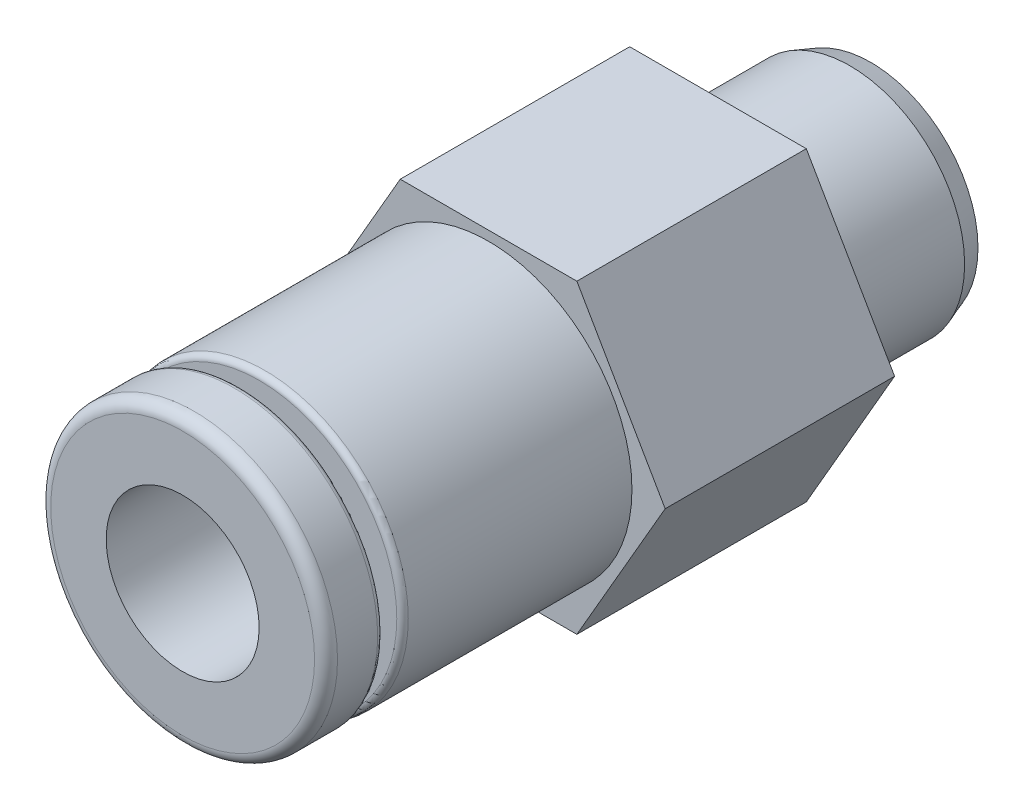
ISO-10303-21;
HEADER;
FILE_DESCRIPTION(('STEP AP214'),'2;1');
FILE_NAME('part.step','',(''),(''),'','','');
FILE_SCHEMA(('AUTOMOTIVE_DESIGN { 1 0 10303 214 1 1 1 1 }'));
ENDSEC;
DATA;
#1=APPLICATION_CONTEXT('core data for automotive mechanical design processes');
#2=APPLICATION_PROTOCOL_DEFINITION('international standard','automotive_design',2000,#1);
#3=PRODUCT_CONTEXT('',#1,'mechanical');
#4=PRODUCT('Part','Part','',(#3));
#5=PRODUCT_RELATED_PRODUCT_CATEGORY('part','',(#4));
#6=PRODUCT_DEFINITION_FORMATION('','',#4);
#7=PRODUCT_DEFINITION_CONTEXT('part definition',#1,'design');
#8=PRODUCT_DEFINITION('design','',#6,#7);
#9=PRODUCT_DEFINITION_SHAPE('','',#8);
#10=(LENGTH_UNIT() NAMED_UNIT(*) SI_UNIT(.MILLI.,.METRE.));
#11=(NAMED_UNIT(*) PLANE_ANGLE_UNIT() SI_UNIT($,.RADIAN.));
#12=(NAMED_UNIT(*) SI_UNIT($,.STERADIAN.) SOLID_ANGLE_UNIT());
#13=UNCERTAINTY_MEASURE_WITH_UNIT(LENGTH_MEASURE(1.E-05),#10,'distance_accuracy_value','');
#14=(GEOMETRIC_REPRESENTATION_CONTEXT(3) GLOBAL_UNCERTAINTY_ASSIGNED_CONTEXT((#13)) GLOBAL_UNIT_ASSIGNED_CONTEXT((#10,
#11,#12)) REPRESENTATION_CONTEXT('',''));
#15=CARTESIAN_POINT('',(0.,0.,0.));
#16=DIRECTION('',(0.,0.,1.));
#17=DIRECTION('',(1.,0.,0.));
#18=AXIS2_PLACEMENT_3D('',#15,#16,#17);
#19=CARTESIAN_POINT('',(0.,0.,18.));
#20=DIRECTION('',(0.,0.,-1.));
#21=DIRECTION('',(-1.,0.,0.));
#22=AXIS2_PLACEMENT_3D('',#19,#20,#21);
#23=CYLINDRICAL_SURFACE('',#22,3.75);
#24=CARTESIAN_POINT('',(0.,0.,15.85));
#25=DIRECTION('',(0.,0.,-1.));
#26=DIRECTION('',(-1.,0.,0.));
#27=AXIS2_PLACEMENT_3D('',#24,#25,#26);
#28=CIRCLE('',#27,3.75);
#29=CARTESIAN_POINT('',(-3.75,0.,15.85));
#30=VERTEX_POINT('',#29);
#31=EDGE_CURVE('E11',#30,#30,#28,.T.);
#32=ORIENTED_EDGE('',*,*,#31,.T.);
#33=EDGE_LOOP('',(#32));
#34=FACE_BOUND('',#33,.T.);
#35=CARTESIAN_POINT('',(0.,0.,10.));
#36=DIRECTION('',(0.,0.,1.));
#37=DIRECTION('',(1.,0.,0.));
#38=AXIS2_PLACEMENT_3D('',#35,#36,#37);
#39=CIRCLE('',#38,3.75);
#40=CARTESIAN_POINT('',(3.75,0.,10.));
#41=VERTEX_POINT('',#40);
#42=EDGE_CURVE('E125',#41,#41,#39,.T.);
#43=ORIENTED_EDGE('',*,*,#42,.T.);
#44=EDGE_LOOP('',(#43));
#45=FACE_BOUND('',#44,.T.);
#46=ADVANCED_FACE('F34',(#34,#45),#23,.T.);
#47=CARTESIAN_POINT('',(0.,0.,10.));
#48=DIRECTION('',(0.,0.,1.));
#49=DIRECTION('',(1.,0.,0.));
#50=AXIS2_PLACEMENT_3D('',#47,#48,#49);
#51=PLANE('',#50);
#52=DIRECTION('',(1.,0.,0.));
#53=VECTOR('',#52,1.);
#54=CARTESIAN_POINT('',(-2.3094010767585,-4.,10.));
#55=LINE('',#54,#53);
#56=CARTESIAN_POINT('',(-2.3094010767585,-4.,10.));
#57=VERTEX_POINT('',#56);
#58=CARTESIAN_POINT('',(2.3094010767585,-4.,10.));
#59=VERTEX_POINT('',#58);
#60=EDGE_CURVE('E132',#57,#59,#55,.T.);
#61=ORIENTED_EDGE('',*,*,#60,.T.);
#62=DIRECTION('',(0.5,0.866025403784439,0.));
#63=VECTOR('',#62,1.);
#64=CARTESIAN_POINT('',(2.3094010767585,-4.,10.));
#65=LINE('',#64,#63);
#66=CARTESIAN_POINT('',(4.61880215351701,0.,10.));
#67=VERTEX_POINT('',#66);
#68=EDGE_CURVE('E89',#59,#67,#65,.T.);
#69=ORIENTED_EDGE('',*,*,#68,.T.);
#70=DIRECTION('',(-0.5,0.866025403784439,0.));
#71=VECTOR('',#70,1.);
#72=CARTESIAN_POINT('',(4.61880215351701,0.,10.));
#73=LINE('',#72,#71);
#74=CARTESIAN_POINT('',(2.3094010767585,4.,10.));
#75=VERTEX_POINT('',#74);
#76=EDGE_CURVE('E103',#67,#75,#73,.T.);
#77=ORIENTED_EDGE('',*,*,#76,.T.);
#78=DIRECTION('',(-1.,0.,0.));
#79=VECTOR('',#78,1.);
#80=CARTESIAN_POINT('',(2.3094010767585,4.,10.));
#81=LINE('',#80,#79);
#82=CARTESIAN_POINT('',(-2.3094010767585,4.,10.));
#83=VERTEX_POINT('',#82);
#84=EDGE_CURVE('E96',#75,#83,#81,.T.);
#85=ORIENTED_EDGE('',*,*,#84,.T.);
#86=DIRECTION('',(-0.5,-0.866025403784439,0.));
#87=VECTOR('',#86,1.);
#88=CARTESIAN_POINT('',(-2.3094010767585,4.,10.));
#89=LINE('',#88,#87);
#90=CARTESIAN_POINT('',(-4.61880215351701,0.,10.));
#91=VERTEX_POINT('',#90);
#92=EDGE_CURVE('E101',#83,#91,#89,.T.);
#93=ORIENTED_EDGE('',*,*,#92,.T.);
#94=DIRECTION('',(0.5,-0.866025403784439,0.));
#95=VECTOR('',#94,1.);
#96=CARTESIAN_POINT('',(-4.61880215351701,0.,10.));
#97=LINE('',#96,#95);
#98=EDGE_CURVE('E51',#91,#57,#97,.T.);
#99=ORIENTED_EDGE('',*,*,#98,.T.);
#100=EDGE_LOOP('',(#61,#69,#77,#85,#93,#99));
#101=FACE_BOUND('',#100,.T.);
#102=ORIENTED_EDGE('',*,*,#42,.F.);
#103=EDGE_LOOP('',(#102));
#104=FACE_BOUND('',#103,.T.);
#105=ADVANCED_FACE('F98',(#101,#104),#51,.T.);
#106=CARTESIAN_POINT('',(0.,0.,4.));
#107=DIRECTION('',(0.,0.,1.));
#108=DIRECTION('',(1.,0.,0.));
#109=AXIS2_PLACEMENT_3D('',#106,#107,#108);
#110=PLANE('',#109);
#111=CARTESIAN_POINT('',(0.,0.,4.));
#112=DIRECTION('',(0.,0.,1.));
#113=DIRECTION('',(1.,0.,0.));
#114=AXIS2_PLACEMENT_3D('',#111,#112,#113);
#115=CIRCLE('',#114,1.25);
#116=CARTESIAN_POINT('',(1.25,0.,4.));
#117=VERTEX_POINT('',#116);
#118=EDGE_CURVE('E142',#117,#117,#115,.T.);
#119=ORIENTED_EDGE('',*,*,#118,.F.);
#120=EDGE_LOOP('',(#119));
#121=FACE_BOUND('',#120,.T.);
#122=CARTESIAN_POINT('',(0.,0.,4.));
#123=DIRECTION('',(0.,0.,1.));
#124=DIRECTION('',(1.,0.,0.));
#125=AXIS2_PLACEMENT_3D('',#122,#123,#124);
#126=CIRCLE('',#125,2.);
#127=CARTESIAN_POINT('',(2.,0.,4.));
#128=VERTEX_POINT('',#127);
#129=EDGE_CURVE('E153',#128,#128,#126,.F.);
#130=ORIENTED_EDGE('',*,*,#129,.F.);
#131=EDGE_LOOP('',(#130));
#132=FACE_BOUND('',#131,.T.);
#133=ADVANCED_FACE('F195',(#121,#132),#110,.T.);
#134=CARTESIAN_POINT('',(0.,0.,0.));
#135=DIRECTION('',(0.,0.,1.));
#136=DIRECTION('',(1.,0.,0.));
#137=AXIS2_PLACEMENT_3D('',#134,#135,#136);
#138=PLANE('',#137);
#139=CARTESIAN_POINT('',(0.,0.,0.));
#140=DIRECTION('',(0.,0.,1.));
#141=DIRECTION('',(1.,0.,0.));
#142=AXIS2_PLACEMENT_3D('',#139,#140,#141);
#143=CIRCLE('',#142,2.8);
#144=CARTESIAN_POINT('',(2.8,0.,0.));
#145=VERTEX_POINT('',#144);
#146=EDGE_CURVE('E150',#145,#145,#143,.F.);
#147=ORIENTED_EDGE('',*,*,#146,.T.);
#148=EDGE_LOOP('',(#147));
#149=FACE_BOUND('',#148,.T.);
#150=CARTESIAN_POINT('',(0.,0.,0.));
#151=DIRECTION('',(0.,0.,1.));
#152=DIRECTION('',(1.,0.,0.));
#153=AXIS2_PLACEMENT_3D('',#150,#151,#152);
#154=CIRCLE('',#153,1.25);
#155=CARTESIAN_POINT('',(1.25,0.,0.));
#156=VERTEX_POINT('',#155);
#157=EDGE_CURVE('E141',#156,#156,#154,.T.);
#158=ORIENTED_EDGE('',*,*,#157,.T.);
#159=EDGE_LOOP('',(#158));
#160=FACE_BOUND('',#159,.T.);
#161=ADVANCED_FACE('F274',(#149,#160),#138,.F.);
#162=CARTESIAN_POINT('',(0.,0.,4.));
#163=DIRECTION('',(0.,0.,-1.));
#164=DIRECTION('',(-1.,0.,0.));
#165=AXIS2_PLACEMENT_3D('',#162,#163,#164);
#166=CYLINDRICAL_SURFACE('',#165,3.);
#167=CARTESIAN_POINT('',(0.,0.,3.7));
#168=DIRECTION('',(0.,0.,1.));
#169=DIRECTION('',(1.,0.,0.));
#170=AXIS2_PLACEMENT_3D('',#167,#168,#169);
#171=CIRCLE('',#170,3.);
#172=CARTESIAN_POINT('',(3.,0.,3.7));
#173=VERTEX_POINT('',#172);
#174=EDGE_CURVE('E159',#173,#173,#171,.F.);
#175=ORIENTED_EDGE('',*,*,#174,.T.);
#176=EDGE_LOOP('',(#175));
#177=FACE_BOUND('',#176,.T.);
#178=CARTESIAN_POINT('',(0.,0.,0.54949548389093));
#179=DIRECTION('',(0.,0.,1.));
#180=DIRECTION('',(1.,0.,0.));
#181=AXIS2_PLACEMENT_3D('',#178,#179,#180);
#182=CIRCLE('',#181,3.);
#183=CARTESIAN_POINT('',(3.,0.,0.54949548389093));
#184=VERTEX_POINT('',#183);
#185=EDGE_CURVE('E145',#184,#184,#182,.T.);
#186=ORIENTED_EDGE('',*,*,#185,.T.);
#187=EDGE_LOOP('',(#186));
#188=FACE_BOUND('',#187,.T.);
#189=ADVANCED_FACE('F270',(#177,#188),#166,.T.);
#190=CARTESIAN_POINT('',(0.,0.,4.));
#191=DIRECTION('',(0.,0.,-1.));
#192=DIRECTION('',(-1.,0.,0.));
#193=AXIS2_PLACEMENT_3D('',#190,#191,#192);
#194=CYLINDRICAL_SURFACE('',#193,1.25);
#195=ORIENTED_EDGE('',*,*,#118,.T.);
#196=EDGE_LOOP('',(#195));
#197=FACE_BOUND('',#196,.T.);
#198=ORIENTED_EDGE('',*,*,#157,.F.);
#199=EDGE_LOOP('',(#198));
#200=FACE_BOUND('',#199,.T.);
#201=ADVANCED_FACE('F266',(#197,#200),#194,.F.);
#202=CARTESIAN_POINT('',(0.,0.,0.54949548389093));
#203=DIRECTION('',(0.,0.,1.));
#204=DIRECTION('',(1.,0.,0.));
#205=AXIS2_PLACEMENT_3D('',#202,#203,#204);
#206=CONICAL_SURFACE('',#205,3.,0.349065850398867);
#207=ORIENTED_EDGE('',*,*,#146,.F.);
#208=EDGE_LOOP('',(#207));
#209=FACE_BOUND('',#208,.T.);
#210=ORIENTED_EDGE('',*,*,#185,.F.);
#211=EDGE_LOOP('',(#210));
#212=FACE_BOUND('',#211,.T.);
#213=ADVANCED_FACE('F269',(#209,#212),#206,.T.);
#214=CARTESIAN_POINT('',(0.,0.,4.));
#215=DIRECTION('',(0.,0.,1.));
#216=DIRECTION('',(1.,0.,0.));
#217=AXIS2_PLACEMENT_3D('',#214,#215,#216);
#218=PLANE('',#217);
#219=CARTESIAN_POINT('',(0.,0.,4.));
#220=DIRECTION('',(0.,0.,1.));
#221=DIRECTION('',(1.,0.,0.));
#222=AXIS2_PLACEMENT_3D('',#219,#220,#221);
#223=CIRCLE('',#222,3.3);
#224=CARTESIAN_POINT('',(3.3,0.,4.));
#225=VERTEX_POINT('',#224);
#226=EDGE_CURVE('E156',#225,#225,#223,.T.);
#227=ORIENTED_EDGE('',*,*,#226,.T.);
#228=EDGE_LOOP('',(#227));
#229=FACE_BOUND('',#228,.T.);
#230=DIRECTION('',(1.,0.,0.));
#231=VECTOR('',#230,1.);
#232=CARTESIAN_POINT('',(-2.3094010767585,-4.,4.));
#233=LINE('',#232,#231);
#234=CARTESIAN_POINT('',(-2.3094010767585,-4.,4.));
#235=VERTEX_POINT('',#234);
#236=CARTESIAN_POINT('',(2.3094010767585,-4.,4.));
#237=VERTEX_POINT('',#236);
#238=EDGE_CURVE('E121',#235,#237,#233,.T.);
#239=ORIENTED_EDGE('',*,*,#238,.F.);
#240=DIRECTION('',(0.5,-0.866025403784439,0.));
#241=VECTOR('',#240,1.);
#242=CARTESIAN_POINT('',(-4.61880215351701,0.,4.));
#243=LINE('',#242,#241);
#244=CARTESIAN_POINT('',(-4.61880215351701,0.,4.));
#245=VERTEX_POINT('',#244);
#246=EDGE_CURVE('E80',#245,#235,#243,.T.);
#247=ORIENTED_EDGE('',*,*,#246,.F.);
#248=DIRECTION('',(-0.5,-0.866025403784439,0.));
#249=VECTOR('',#248,1.);
#250=CARTESIAN_POINT('',(-2.3094010767585,4.,4.));
#251=LINE('',#250,#249);
#252=CARTESIAN_POINT('',(-2.3094010767585,4.,4.));
#253=VERTEX_POINT('',#252);
#254=EDGE_CURVE('E74',#253,#245,#251,.T.);
#255=ORIENTED_EDGE('',*,*,#254,.F.);
#256=DIRECTION('',(-1.,0.,0.));
#257=VECTOR('',#256,1.);
#258=CARTESIAN_POINT('',(2.3094010767585,4.,4.));
#259=LINE('',#258,#257);
#260=CARTESIAN_POINT('',(2.3094010767585,4.,4.));
#261=VERTEX_POINT('',#260);
#262=EDGE_CURVE('E111',#261,#253,#259,.T.);
#263=ORIENTED_EDGE('',*,*,#262,.F.);
#264=DIRECTION('',(-0.5,0.866025403784439,0.));
#265=VECTOR('',#264,1.);
#266=CARTESIAN_POINT('',(4.61880215351701,0.,4.));
#267=LINE('',#266,#265);
#268=CARTESIAN_POINT('',(4.61880215351701,0.,4.));
#269=VERTEX_POINT('',#268);
#270=EDGE_CURVE('E127',#269,#261,#267,.T.);
#271=ORIENTED_EDGE('',*,*,#270,.F.);
#272=DIRECTION('',(0.5,0.866025403784439,0.));
#273=VECTOR('',#272,1.);
#274=CARTESIAN_POINT('',(2.3094010767585,-4.,4.));
#275=LINE('',#274,#273);
#276=EDGE_CURVE('E124',#237,#269,#275,.T.);
#277=ORIENTED_EDGE('',*,*,#276,.F.);
#278=EDGE_LOOP('',(#239,#247,#255,#263,#271,#277));
#279=FACE_BOUND('',#278,.T.);
#280=ADVANCED_FACE('F244',(#229,#279),#218,.F.);
#281=CARTESIAN_POINT('',(-2.3094010767585,-4.,10.));
#282=DIRECTION('',(0.,1.,0.));
#283=DIRECTION('',(-1.,0.,0.));
#284=AXIS2_PLACEMENT_3D('',#281,#282,#283);
#285=PLANE('',#284);
#286=ORIENTED_EDGE('',*,*,#238,.T.);
#287=DIRECTION('',(0.,0.,-1.));
#288=VECTOR('',#287,1.);
#289=CARTESIAN_POINT('',(2.3094010767585,-4.,10.));
#290=LINE('',#289,#288);
#291=EDGE_CURVE('E139',#59,#237,#290,.T.);
#292=ORIENTED_EDGE('',*,*,#291,.F.);
#293=ORIENTED_EDGE('',*,*,#60,.F.);
#294=DIRECTION('',(0.,0.,-1.));
#295=VECTOR('',#294,1.);
#296=CARTESIAN_POINT('',(-2.3094010767585,-4.,10.));
#297=LINE('',#296,#295);
#298=EDGE_CURVE('E117',#57,#235,#297,.T.);
#299=ORIENTED_EDGE('',*,*,#298,.T.);
#300=EDGE_LOOP('',(#286,#292,#293,#299));
#301=FACE_BOUND('',#300,.T.);
#302=ADVANCED_FACE('F246',(#301),#285,.F.);
#303=CARTESIAN_POINT('',(2.3094010767585,-4.,10.));
#304=DIRECTION('',(-0.866025403784439,0.5,0.));
#305=DIRECTION('',(-0.5,-0.866025403784439,0.));
#306=AXIS2_PLACEMENT_3D('',#303,#304,#305);
#307=PLANE('',#306);
#308=ORIENTED_EDGE('',*,*,#276,.T.);
#309=DIRECTION('',(0.,0.,-1.));
#310=VECTOR('',#309,1.);
#311=CARTESIAN_POINT('',(4.61880215351701,0.,10.));
#312=LINE('',#311,#310);
#313=EDGE_CURVE('E136',#67,#269,#312,.T.);
#314=ORIENTED_EDGE('',*,*,#313,.F.);
#315=ORIENTED_EDGE('',*,*,#68,.F.);
#316=ORIENTED_EDGE('',*,*,#291,.T.);
#317=EDGE_LOOP('',(#308,#314,#315,#316));
#318=FACE_BOUND('',#317,.T.);
#319=ADVANCED_FACE('F238',(#318),#307,.F.);
#320=CARTESIAN_POINT('',(4.61880215351701,0.,10.));
#321=DIRECTION('',(-0.866025403784439,-0.5,0.));
#322=DIRECTION('',(0.5,-0.866025403784439,0.));
#323=AXIS2_PLACEMENT_3D('',#320,#321,#322);
#324=PLANE('',#323);
#325=ORIENTED_EDGE('',*,*,#270,.T.);
#326=DIRECTION('',(0.,0.,-1.));
#327=VECTOR('',#326,1.);
#328=CARTESIAN_POINT('',(2.3094010767585,4.,10.));
#329=LINE('',#328,#327);
#330=EDGE_CURVE('E112',#75,#261,#329,.T.);
#331=ORIENTED_EDGE('',*,*,#330,.F.);
#332=ORIENTED_EDGE('',*,*,#76,.F.);
#333=ORIENTED_EDGE('',*,*,#313,.T.);
#334=EDGE_LOOP('',(#325,#331,#332,#333));
#335=FACE_BOUND('',#334,.T.);
#336=ADVANCED_FACE('F241',(#335),#324,.F.);
#337=CARTESIAN_POINT('',(2.3094010767585,4.,10.));
#338=DIRECTION('',(0.,-1.,0.));
#339=DIRECTION('',(1.,0.,0.));
#340=AXIS2_PLACEMENT_3D('',#337,#338,#339);
#341=PLANE('',#340);
#342=ORIENTED_EDGE('',*,*,#262,.T.);
#343=DIRECTION('',(0.,0.,-1.));
#344=VECTOR('',#343,1.);
#345=CARTESIAN_POINT('',(-2.3094010767585,4.,10.));
#346=LINE('',#345,#344);
#347=EDGE_CURVE('E108',#83,#253,#346,.T.);
#348=ORIENTED_EDGE('',*,*,#347,.F.);
#349=ORIENTED_EDGE('',*,*,#84,.F.);
#350=ORIENTED_EDGE('',*,*,#330,.T.);
#351=EDGE_LOOP('',(#342,#348,#349,#350));
#352=FACE_BOUND('',#351,.T.);
#353=ADVANCED_FACE('F109',(#352),#341,.F.);
#354=CARTESIAN_POINT('',(-2.3094010767585,4.,10.));
#355=DIRECTION('',(0.866025403784438,-0.5,0.));
#356=DIRECTION('',(0.5,0.866025403784439,0.));
#357=AXIS2_PLACEMENT_3D('',#354,#355,#356);
#358=PLANE('',#357);
#359=ORIENTED_EDGE('',*,*,#254,.T.);
#360=DIRECTION('',(0.,0.,-1.));
#361=VECTOR('',#360,1.);
#362=CARTESIAN_POINT('',(-4.61880215351701,0.,10.));
#363=LINE('',#362,#361);
#364=EDGE_CURVE('E113',#91,#245,#363,.T.);
#365=ORIENTED_EDGE('',*,*,#364,.F.);
#366=ORIENTED_EDGE('',*,*,#92,.F.);
#367=ORIENTED_EDGE('',*,*,#347,.T.);
#368=EDGE_LOOP('',(#359,#365,#366,#367));
#369=FACE_BOUND('',#368,.T.);
#370=ADVANCED_FACE('F115',(#369),#358,.F.);
#371=CARTESIAN_POINT('',(-4.61880215351701,0.,10.));
#372=DIRECTION('',(0.866025403784439,0.5,0.));
#373=DIRECTION('',(-0.5,0.866025403784439,0.));
#374=AXIS2_PLACEMENT_3D('',#371,#372,#373);
#375=PLANE('',#374);
#376=ORIENTED_EDGE('',*,*,#246,.T.);
#377=ORIENTED_EDGE('',*,*,#298,.F.);
#378=ORIENTED_EDGE('',*,*,#98,.F.);
#379=ORIENTED_EDGE('',*,*,#364,.T.);
#380=EDGE_LOOP('',(#376,#377,#378,#379));
#381=FACE_BOUND('',#380,.T.);
#382=ADVANCED_FACE('F247',(#381),#375,.F.);
#383=CARTESIAN_POINT('',(0.,0.,10.));
#384=DIRECTION('',(0.,0.,-1.));
#385=DIRECTION('',(-1.,0.,0.));
#386=AXIS2_PLACEMENT_3D('',#383,#384,#385);
#387=CYLINDRICAL_SURFACE('',#386,2.);
#388=ORIENTED_EDGE('',*,*,#129,.T.);
#389=EDGE_LOOP('',(#388));
#390=FACE_BOUND('',#389,.T.);
#391=CARTESIAN_POINT('',(0.,0.,18.));
#392=DIRECTION('',(0.,0.,1.));
#393=DIRECTION('',(1.,0.,0.));
#394=AXIS2_PLACEMENT_3D('',#391,#392,#393);
#395=CIRCLE('',#394,2.);
#396=CARTESIAN_POINT('',(2.,0.,18.));
#397=VERTEX_POINT('',#396);
#398=EDGE_CURVE('E224',#397,#397,#395,.T.);
#399=ORIENTED_EDGE('',*,*,#398,.T.);
#400=EDGE_LOOP('',(#399));
#401=FACE_BOUND('',#400,.T.);
#402=ADVANCED_FACE('F210',(#390,#401),#387,.F.);
#403=CARTESIAN_POINT('',(0.,0.,18.));
#404=DIRECTION('',(0.,0.,1.));
#405=DIRECTION('',(1.,0.,0.));
#406=AXIS2_PLACEMENT_3D('',#403,#404,#405);
#407=PLANE('',#406);
#408=CARTESIAN_POINT('',(0.,0.,18.));
#409=DIRECTION('',(0.,0.,1.));
#410=DIRECTION('',(1.,0.,0.));
#411=AXIS2_PLACEMENT_3D('',#408,#409,#410);
#412=CIRCLE('',#411,3.45);
#413=CARTESIAN_POINT('',(3.45,0.,18.));
#414=VERTEX_POINT('',#413);
#415=EDGE_CURVE('E162',#414,#414,#412,.T.);
#416=ORIENTED_EDGE('',*,*,#415,.T.);
#417=EDGE_LOOP('',(#416));
#418=FACE_BOUND('',#417,.T.);
#419=ORIENTED_EDGE('',*,*,#398,.F.);
#420=EDGE_LOOP('',(#419));
#421=FACE_BOUND('',#420,.T.);
#422=ADVANCED_FACE('F202',(#418,#421),#407,.T.);
#423=CARTESIAN_POINT('',(0.,0.,16.65));
#424=DIRECTION('',(0.,0.,1.));
#425=DIRECTION('',(1.,0.,0.));
#426=AXIS2_PLACEMENT_3D('',#423,#424,#425);
#427=CIRCLE('',#426,3.75);
#428=CARTESIAN_POINT('',(3.75,0.,16.65));
#429=VERTEX_POINT('',#428);
#430=EDGE_CURVE('E168',#429,#429,#427,.T.);
#431=ORIENTED_EDGE('',*,*,#430,.T.);
#432=EDGE_LOOP('',(#431));
#433=FACE_BOUND('',#432,.T.);
#434=CARTESIAN_POINT('',(0.,0.,17.7));
#435=DIRECTION('',(0.,0.,1.));
#436=DIRECTION('',(1.,0.,0.));
#437=AXIS2_PLACEMENT_3D('',#434,#435,#436);
#438=CIRCLE('',#437,3.75);
#439=CARTESIAN_POINT('',(3.75,0.,17.7));
#440=VERTEX_POINT('',#439);
#441=EDGE_CURVE('E165',#440,#440,#438,.F.);
#442=ORIENTED_EDGE('',*,*,#441,.T.);
#443=EDGE_LOOP('',(#442));
#444=FACE_BOUND('',#443,.T.);
#445=ADVANCED_FACE('F191',(#433,#444),#23,.T.);
#446=CARTESIAN_POINT('',(0.,0.,3.7));
#447=DIRECTION('',(0.,0.,1.));
#448=DIRECTION('',(1.,0.,0.));
#449=AXIS2_PLACEMENT_3D('',#446,#447,#448);
#450=TOROIDAL_SURFACE('',#449,3.3,0.3);
#451=ORIENTED_EDGE('',*,*,#174,.F.);
#452=EDGE_LOOP('',(#451));
#453=FACE_BOUND('',#452,.T.);
#454=ORIENTED_EDGE('',*,*,#226,.F.);
#455=EDGE_LOOP('',(#454));
#456=FACE_BOUND('',#455,.T.);
#457=ADVANCED_FACE('F201',(#453,#456),#450,.F.);
#458=CARTESIAN_POINT('',(3.75,0.,16.));
#459=DIRECTION('',(0.,0.,-1.));
#460=DIRECTION('',(-1.,0.,0.));
#461=AXIS2_PLACEMENT_3D('',#458,#459,#460);
#462=PLANE('',#461);
#463=CARTESIAN_POINT('',(0.,0.,16.));
#464=DIRECTION('',(0.,0.,-1.));
#465=DIRECTION('',(-1.,0.,0.));
#466=AXIS2_PLACEMENT_3D('',#463,#464,#465);
#467=CIRCLE('',#466,3.6);
#468=CARTESIAN_POINT('',(-3.6,0.,16.));
#469=VERTEX_POINT('',#468);
#470=EDGE_CURVE('E43',#469,#469,#467,.F.);
#471=ORIENTED_EDGE('',*,*,#470,.T.);
#472=EDGE_LOOP('',(#471));
#473=FACE_BOUND('',#472,.T.);
#474=CARTESIAN_POINT('',(0.,0.,16.));
#475=DIRECTION('',(0.,0.,1.));
#476=DIRECTION('',(1.,0.,0.));
#477=AXIS2_PLACEMENT_3D('',#474,#475,#476);
#478=CIRCLE('',#477,2.25);
#479=CARTESIAN_POINT('',(2.25,0.,16.));
#480=VERTEX_POINT('',#479);
#481=EDGE_CURVE('E226',#480,#480,#478,.T.);
#482=ORIENTED_EDGE('',*,*,#481,.F.);
#483=EDGE_LOOP('',(#482));
#484=FACE_BOUND('',#483,.T.);
#485=ADVANCED_FACE('F176',(#473,#484),#462,.F.);
#486=CARTESIAN_POINT('',(0.,0.,52.2414434786733));
#487=DIRECTION('',(0.,0.,1.));
#488=DIRECTION('',(1.,0.,0.));
#489=AXIS2_PLACEMENT_3D('',#486,#487,#488);
#490=CYLINDRICAL_SURFACE('',#489,2.25);
#491=CARTESIAN_POINT('',(0.,0.,16.5));
#492=DIRECTION('',(0.,0.,1.));
#493=DIRECTION('',(1.,0.,0.));
#494=AXIS2_PLACEMENT_3D('',#491,#492,#493);
#495=CIRCLE('',#494,2.25);
#496=CARTESIAN_POINT('',(2.25,0.,16.5));
#497=VERTEX_POINT('',#496);
#498=EDGE_CURVE('E231',#497,#497,#495,.T.);
#499=ORIENTED_EDGE('',*,*,#498,.F.);
#500=EDGE_LOOP('',(#499));
#501=FACE_BOUND('',#500,.T.);
#502=ORIENTED_EDGE('',*,*,#481,.T.);
#503=EDGE_LOOP('',(#502));
#504=FACE_BOUND('',#503,.T.);
#505=ADVANCED_FACE('F355',(#501,#504),#490,.T.);
#506=CARTESIAN_POINT('',(3.75,0.,16.5));
#507=DIRECTION('',(0.,0.,1.));
#508=DIRECTION('',(1.,0.,0.));
#509=AXIS2_PLACEMENT_3D('',#506,#507,#508);
#510=PLANE('',#509);
#511=CARTESIAN_POINT('',(0.,0.,16.5));
#512=DIRECTION('',(0.,0.,1.));
#513=DIRECTION('',(1.,0.,0.));
#514=AXIS2_PLACEMENT_3D('',#511,#512,#513);
#515=CIRCLE('',#514,3.6);
#516=CARTESIAN_POINT('',(3.6,0.,16.5));
#517=VERTEX_POINT('',#516);
#518=EDGE_CURVE('E171',#517,#517,#515,.F.);
#519=ORIENTED_EDGE('',*,*,#518,.T.);
#520=EDGE_LOOP('',(#519));
#521=FACE_BOUND('',#520,.T.);
#522=ORIENTED_EDGE('',*,*,#498,.T.);
#523=EDGE_LOOP('',(#522));
#524=FACE_BOUND('',#523,.T.);
#525=ADVANCED_FACE('F218',(#521,#524),#510,.F.);
#526=CARTESIAN_POINT('',(0.,0.,17.7));
#527=DIRECTION('',(0.,0.,1.));
#528=DIRECTION('',(1.,0.,0.));
#529=AXIS2_PLACEMENT_3D('',#526,#527,#528);
#530=TOROIDAL_SURFACE('',#529,3.45,0.3);
#531=ORIENTED_EDGE('',*,*,#441,.F.);
#532=EDGE_LOOP('',(#531));
#533=FACE_BOUND('',#532,.T.);
#534=ORIENTED_EDGE('',*,*,#415,.F.);
#535=EDGE_LOOP('',(#534));
#536=FACE_BOUND('',#535,.T.);
#537=ADVANCED_FACE('F185',(#533,#536),#530,.T.);
#538=CARTESIAN_POINT('',(0.,0.,16.65));
#539=DIRECTION('',(0.,0.,1.));
#540=DIRECTION('',(1.,0.,0.));
#541=AXIS2_PLACEMENT_3D('',#538,#539,#540);
#542=TOROIDAL_SURFACE('',#541,3.6,0.15);
#543=ORIENTED_EDGE('',*,*,#518,.F.);
#544=EDGE_LOOP('',(#543));
#545=FACE_BOUND('',#544,.T.);
#546=ORIENTED_EDGE('',*,*,#430,.F.);
#547=EDGE_LOOP('',(#546));
#548=FACE_BOUND('',#547,.T.);
#549=ADVANCED_FACE('F180',(#545,#548),#542,.T.);
#550=CARTESIAN_POINT('',(0.,0.,15.85));
#551=DIRECTION('',(0.,0.,-1.));
#552=DIRECTION('',(-1.,0.,0.));
#553=AXIS2_PLACEMENT_3D('',#550,#551,#552);
#554=TOROIDAL_SURFACE('',#553,3.6,0.15);
#555=ORIENTED_EDGE('',*,*,#31,.F.);
#556=EDGE_LOOP('',(#555));
#557=FACE_BOUND('',#556,.T.);
#558=ORIENTED_EDGE('',*,*,#470,.F.);
#559=EDGE_LOOP('',(#558));
#560=FACE_BOUND('',#559,.T.);
#561=ADVANCED_FACE('F36',(#557,#560),#554,.T.);
#562=CLOSED_SHELL('',(#46,#105,#133,#161,#189,#201,#213,#280,#302,#319,#336,#353,#370,#382,#402,
#422,#445,#457,#485,#505,#525,#537,#549,#561));
#563=MANIFOLD_SOLID_BREP('B2',#562);
#564=ADVANCED_BREP_SHAPE_REPRESENTATION('',(#18,#563),#14);
#565=SHAPE_DEFINITION_REPRESENTATION(#9,#564);
ENDSEC;
END-ISO-10303-21;
